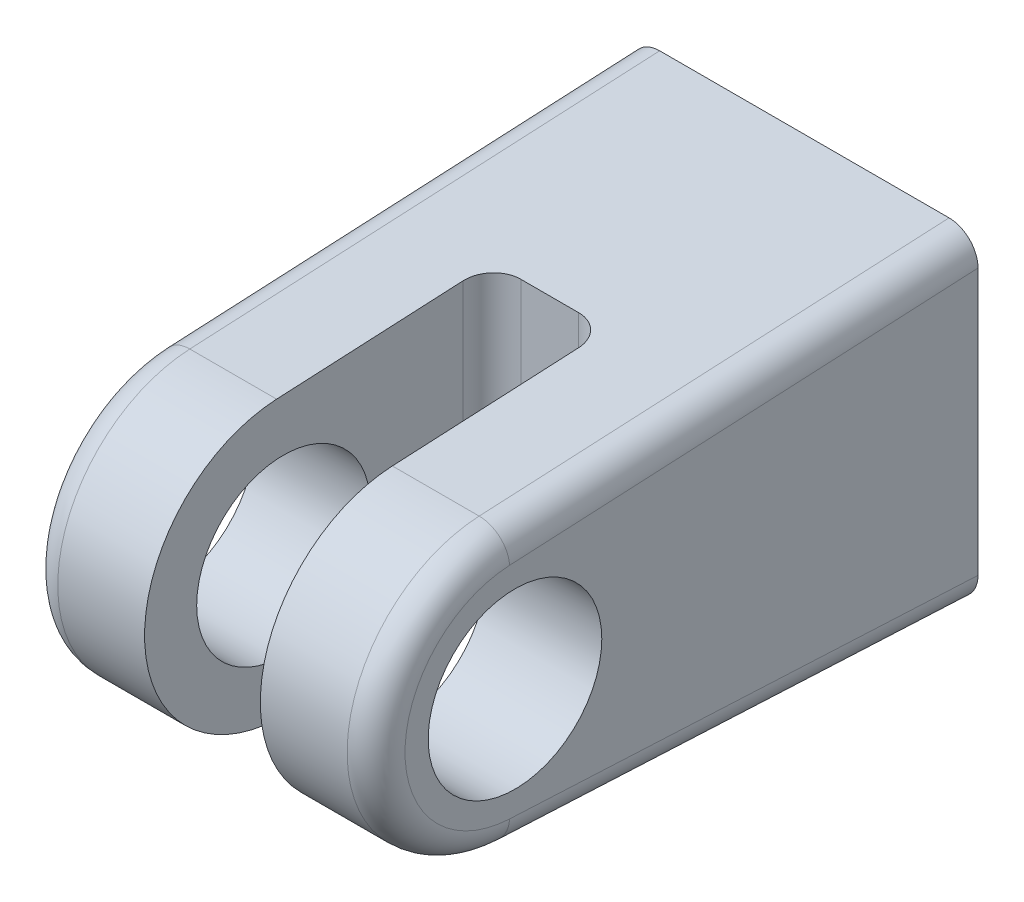
ISO-10303-21;
HEADER;
FILE_DESCRIPTION(('STEP AP214'),'2;1');
FILE_NAME('part.step','',(''),(''),'','','');
FILE_SCHEMA(('AUTOMOTIVE_DESIGN { 1 0 10303 214 1 1 1 1 }'));
ENDSEC;
DATA;
#1=APPLICATION_CONTEXT('core data for automotive mechanical design processes');
#2=APPLICATION_PROTOCOL_DEFINITION('international standard','automotive_design',2000,#1);
#3=PRODUCT_CONTEXT('',#1,'mechanical');
#4=PRODUCT('Part','Part','',(#3));
#5=PRODUCT_RELATED_PRODUCT_CATEGORY('part','',(#4));
#6=PRODUCT_DEFINITION_FORMATION('','',#4);
#7=PRODUCT_DEFINITION_CONTEXT('part definition',#1,'design');
#8=PRODUCT_DEFINITION('design','',#6,#7);
#9=PRODUCT_DEFINITION_SHAPE('','',#8);
#10=(LENGTH_UNIT() NAMED_UNIT(*) SI_UNIT(.MILLI.,.METRE.));
#11=(NAMED_UNIT(*) PLANE_ANGLE_UNIT() SI_UNIT($,.RADIAN.));
#12=(NAMED_UNIT(*) SI_UNIT($,.STERADIAN.) SOLID_ANGLE_UNIT());
#13=UNCERTAINTY_MEASURE_WITH_UNIT(LENGTH_MEASURE(1.E-05),#10,'distance_accuracy_value','');
#14=(GEOMETRIC_REPRESENTATION_CONTEXT(3) GLOBAL_UNCERTAINTY_ASSIGNED_CONTEXT((#13)) GLOBAL_UNIT_ASSIGNED_CONTEXT((#10,
#11,#12)) REPRESENTATION_CONTEXT('',''));
#15=CARTESIAN_POINT('',(0.,0.,0.));
#16=DIRECTION('',(0.,0.,1.));
#17=DIRECTION('',(1.,0.,0.));
#18=AXIS2_PLACEMENT_3D('',#15,#16,#17);
#19=CARTESIAN_POINT('',(9.525,0.,25.4));
#20=DIRECTION('',(-1.,0.,0.));
#21=DIRECTION('',(0.,0.,1.));
#22=AXIS2_PLACEMENT_3D('',#19,#20,#21);
#23=CYLINDRICAL_SURFACE('',#22,7.62);
#24=DIRECTION('',(-1.,0.,0.));
#25=VECTOR('',#24,1.);
#26=CARTESIAN_POINT('',(9.525,-7.61063246853942,25.7777213639888));
#27=LINE('',#26,#25);
#28=CARTESIAN_POINT('',(7.9375,-7.61063246853942,25.7777213639888));
#29=VERTEX_POINT('',#28);
#30=CARTESIAN_POINT('',(3.175,-7.61063246853942,25.7777213639888));
#31=VERTEX_POINT('',#30);
#32=EDGE_CURVE('E137',#29,#31,#27,.T.);
#33=ORIENTED_EDGE('',*,*,#32,.F.);
#34=CARTESIAN_POINT('',(7.9375,0.,25.4));
#35=DIRECTION('',(1.,0.,0.));
#36=DIRECTION('',(0.,0.,-1.));
#37=AXIS2_PLACEMENT_3D('',#34,#35,#36);
#38=CIRCLE('',#37,7.62);
#39=CARTESIAN_POINT('',(7.9375,7.61063246853942,25.7777213639888));
#40=VERTEX_POINT('',#39);
#41=EDGE_CURVE('E205',#29,#40,#38,.F.);
#42=ORIENTED_EDGE('',*,*,#41,.T.);
#43=DIRECTION('',(-1.,0.,0.));
#44=VECTOR('',#43,1.);
#45=CARTESIAN_POINT('',(9.525,7.61063246853942,25.7777213639888));
#46=LINE('',#45,#44);
#47=CARTESIAN_POINT('',(3.175,7.61063246853942,25.7777213639888));
#48=VERTEX_POINT('',#47);
#49=EDGE_CURVE('E156',#40,#48,#46,.T.);
#50=ORIENTED_EDGE('',*,*,#49,.T.);
#51=CARTESIAN_POINT('',(3.175,0.,25.4));
#52=DIRECTION('',(1.,0.,0.));
#53=DIRECTION('',(0.,0.,-1.));
#54=AXIS2_PLACEMENT_3D('',#51,#52,#53);
#55=CIRCLE('',#54,7.62);
#56=EDGE_CURVE('E154',#48,#31,#55,.T.);
#57=ORIENTED_EDGE('',*,*,#56,.T.);
#58=EDGE_LOOP('',(#33,#42,#50,#57));
#59=FACE_BOUND('',#58,.T.);
#60=ADVANCED_FACE('F36',(#59),#23,.T.);
#61=CARTESIAN_POINT('',(9.525,8.89,0.));
#62=DIRECTION('',(0.,0.,1.));
#63=DIRECTION('',(0.,-1.,0.));
#64=AXIS2_PLACEMENT_3D('',#61,#62,#63);
#65=PLANE('',#64);
#66=CARTESIAN_POINT('',(0.,0.,0.));
#67=DIRECTION('',(0.,0.,-1.));
#68=DIRECTION('',(0.,1.,0.));
#69=AXIS2_PLACEMENT_3D('',#66,#67,#68);
#70=CIRCLE('',#69,6.35);
#71=CARTESIAN_POINT('',(0.,6.35,0.));
#72=VERTEX_POINT('',#71);
#73=EDGE_CURVE('E229',#72,#72,#70,.T.);
#74=ORIENTED_EDGE('',*,*,#73,.F.);
#75=EDGE_LOOP('',(#74));
#76=FACE_BOUND('',#75,.T.);
#77=DIRECTION('',(-1.,0.,0.));
#78=VECTOR('',#77,1.);
#79=CARTESIAN_POINT('',(9.525,-8.89,0.));
#80=LINE('',#79,#78);
#81=CARTESIAN_POINT('',(7.9375,-8.89,0.));
#82=VERTEX_POINT('',#81);
#83=CARTESIAN_POINT('',(-7.93749999999999,-8.89,0.));
#84=VERTEX_POINT('',#83);
#85=EDGE_CURVE('E272',#82,#84,#80,.T.);
#86=ORIENTED_EDGE('',*,*,#85,.T.);
#87=CARTESIAN_POINT('',(-7.9375,-7.30054602886092,0.));
#88=DIRECTION('',(0.,0.,1.));
#89=DIRECTION('',(0.,-1.,0.));
#90=AXIS2_PLACEMENT_3D('',#87,#88,#89);
#91=ELLIPSE('',#90,1.58945397113908,1.5875);
#92=CARTESIAN_POINT('',(-9.525,-7.30054602886092,0.));
#93=VERTEX_POINT('',#92);
#94=EDGE_CURVE('E188',#84,#93,#91,.F.);
#95=ORIENTED_EDGE('',*,*,#94,.T.);
#96=DIRECTION('',(0.,1.,0.));
#97=VECTOR('',#96,1.);
#98=CARTESIAN_POINT('',(-9.525,8.89,0.));
#99=LINE('',#98,#97);
#100=CARTESIAN_POINT('',(-9.525,7.30054602886092,0.));
#101=VERTEX_POINT('',#100);
#102=EDGE_CURVE('E256',#93,#101,#99,.T.);
#103=ORIENTED_EDGE('',*,*,#102,.T.);
#104=CARTESIAN_POINT('',(-7.9375,7.30054602886092,0.));
#105=DIRECTION('',(0.,0.,1.));
#106=DIRECTION('',(0.,-1.,0.));
#107=AXIS2_PLACEMENT_3D('',#104,#105,#106);
#108=ELLIPSE('',#107,1.58945397113908,1.5875);
#109=CARTESIAN_POINT('',(-7.93749999999999,8.89,0.));
#110=VERTEX_POINT('',#109);
#111=EDGE_CURVE('E184',#101,#110,#108,.F.);
#112=ORIENTED_EDGE('',*,*,#111,.T.);
#113=DIRECTION('',(-1.,0.,0.));
#114=VECTOR('',#113,1.);
#115=CARTESIAN_POINT('',(9.525,8.89,0.));
#116=LINE('',#115,#114);
#117=CARTESIAN_POINT('',(7.9375,8.89,0.));
#118=VERTEX_POINT('',#117);
#119=EDGE_CURVE('E164',#118,#110,#116,.T.);
#120=ORIENTED_EDGE('',*,*,#119,.F.);
#121=CARTESIAN_POINT('',(7.9375,7.30054602886092,0.));
#122=DIRECTION('',(0.,0.,1.));
#123=DIRECTION('',(0.,1.,0.));
#124=AXIS2_PLACEMENT_3D('',#121,#122,#123);
#125=ELLIPSE('',#124,1.58945397113908,1.5875);
#126=CARTESIAN_POINT('',(9.525,7.30054602886092,0.));
#127=VERTEX_POINT('',#126);
#128=EDGE_CURVE('E182',#118,#127,#125,.F.);
#129=ORIENTED_EDGE('',*,*,#128,.T.);
#130=DIRECTION('',(0.,1.,0.));
#131=VECTOR('',#130,1.);
#132=CARTESIAN_POINT('',(9.525,8.89,0.));
#133=LINE('',#132,#131);
#134=CARTESIAN_POINT('',(9.525,-7.30054602886092,0.));
#135=VERTEX_POINT('',#134);
#136=EDGE_CURVE('E274',#135,#127,#133,.T.);
#137=ORIENTED_EDGE('',*,*,#136,.F.);
#138=CARTESIAN_POINT('',(7.9375,-7.30054602886092,0.));
#139=DIRECTION('',(0.,0.,1.));
#140=DIRECTION('',(0.,1.,0.));
#141=AXIS2_PLACEMENT_3D('',#138,#139,#140);
#142=ELLIPSE('',#141,1.58945397113908,1.5875);
#143=EDGE_CURVE('E186',#135,#82,#142,.F.);
#144=ORIENTED_EDGE('',*,*,#143,.T.);
#145=EDGE_LOOP('',(#86,#95,#103,#112,#120,#129,#137,#144));
#146=FACE_BOUND('',#145,.T.);
#147=ADVANCED_FACE('F250',(#76,#146),#65,.F.);
#148=CARTESIAN_POINT('',(9.525,8.89,0.));
#149=DIRECTION('',(0.,-0.998770665162654,-0.0495697328069288));
#150=DIRECTION('',(0.,0.0495697328069289,-0.998770665162654));
#151=AXIS2_PLACEMENT_3D('',#148,#149,#150);
#152=PLANE('',#151);
#153=ORIENTED_EDGE('',*,*,#119,.T.);
#154=DIRECTION('',(0.,-0.0495697328069289,0.998770665162654));
#155=VECTOR('',#154,1.);
#156=CARTESIAN_POINT('',(-7.9375,8.89,0.));
#157=LINE('',#156,#155);
#158=CARTESIAN_POINT('',(-7.93749999999999,7.61063246853942,25.7777213639888));
#159=VERTEX_POINT('',#158);
#160=EDGE_CURVE('E217',#110,#159,#157,.T.);
#161=ORIENTED_EDGE('',*,*,#160,.T.);
#162=CARTESIAN_POINT('',(-3.175,7.61063246853942,25.7777213639888));
#163=VERTEX_POINT('',#162);
#164=EDGE_CURVE('E149',#163,#159,#46,.T.);
#165=ORIENTED_EDGE('',*,*,#164,.F.);
#166=DIRECTION('',(0.,0.0495697328069289,-0.998770665162654));
#167=VECTOR('',#166,1.);
#168=CARTESIAN_POINT('',(-3.17500000000001,8.89,0.));
#169=LINE('',#168,#167);
#170=CARTESIAN_POINT('',(-3.175,8.11786967514889,15.5575));
#171=VERTEX_POINT('',#170);
#172=EDGE_CURVE('E276',#163,#171,#169,.T.);
#173=ORIENTED_EDGE('',*,*,#172,.T.);
#174=CARTESIAN_POINT('',(-1.5875,8.11786967514889,15.5575));
#175=DIRECTION('',(0.,-0.998770665162654,-0.0495697328069288));
#176=DIRECTION('',(0.,-0.0495697328069289,0.998770665162654));
#177=AXIS2_PLACEMENT_3D('',#174,#175,#176);
#178=ELLIPSE('',#177,1.58945397113908,1.5875);
#179=CARTESIAN_POINT('',(-1.5875,8.19665848380717,13.97));
#180=VERTEX_POINT('',#179);
#181=EDGE_CURVE('E219',#171,#180,#178,.T.);
#182=ORIENTED_EDGE('',*,*,#181,.T.);
#183=DIRECTION('',(1.,0.,0.));
#184=VECTOR('',#183,1.);
#185=CARTESIAN_POINT('',(9.525,8.19665848380717,13.97));
#186=LINE('',#185,#184);
#187=CARTESIAN_POINT('',(1.5875,8.19665848380717,13.97));
#188=VERTEX_POINT('',#187);
#189=EDGE_CURVE('E280',#180,#188,#186,.T.);
#190=ORIENTED_EDGE('',*,*,#189,.T.);
#191=CARTESIAN_POINT('',(1.5875,8.11786967514889,15.5575));
#192=DIRECTION('',(0.,-0.998770665162654,-0.0495697328069288));
#193=DIRECTION('',(0.,-0.0495697328069289,0.998770665162654));
#194=AXIS2_PLACEMENT_3D('',#191,#192,#193);
#195=ELLIPSE('',#194,1.58945397113908,1.5875);
#196=CARTESIAN_POINT('',(3.175,8.11786967514889,15.5575));
#197=VERTEX_POINT('',#196);
#198=EDGE_CURVE('E45',#188,#197,#195,.T.);
#199=ORIENTED_EDGE('',*,*,#198,.T.);
#200=DIRECTION('',(0.,-0.0495697328069289,0.998770665162654));
#201=VECTOR('',#200,1.);
#202=CARTESIAN_POINT('',(3.175,8.89,0.));
#203=LINE('',#202,#201);
#204=EDGE_CURVE('E158',#197,#48,#203,.T.);
#205=ORIENTED_EDGE('',*,*,#204,.T.);
#206=ORIENTED_EDGE('',*,*,#49,.F.);
#207=DIRECTION('',(0.,-0.0495697328069289,0.998770665162654));
#208=VECTOR('',#207,1.);
#209=CARTESIAN_POINT('',(7.9375,8.89,0.));
#210=LINE('',#209,#208);
#211=EDGE_CURVE('E215',#40,#118,#210,.F.);
#212=ORIENTED_EDGE('',*,*,#211,.T.);
#213=EDGE_LOOP('',(#153,#161,#165,#173,#182,#190,#199,#205,#206,#212));
#214=FACE_BOUND('',#213,.T.);
#215=ADVANCED_FACE('F246',(#214),#152,.F.);
#216=ORIENTED_EDGE('',*,*,#164,.T.);
#217=CARTESIAN_POINT('',(-7.9375,0.,25.4));
#218=DIRECTION('',(1.,0.,0.));
#219=DIRECTION('',(0.,0.,-1.));
#220=AXIS2_PLACEMENT_3D('',#217,#218,#219);
#221=CIRCLE('',#220,7.62);
#222=CARTESIAN_POINT('',(-7.93749999999999,-7.61063246853942,25.7777213639888));
#223=VERTEX_POINT('',#222);
#224=EDGE_CURVE('E196',#159,#223,#221,.T.);
#225=ORIENTED_EDGE('',*,*,#224,.T.);
#226=CARTESIAN_POINT('',(-3.175,-7.61063246853942,25.7777213639888));
#227=VERTEX_POINT('',#226);
#228=EDGE_CURVE('E150',#227,#223,#27,.T.);
#229=ORIENTED_EDGE('',*,*,#228,.F.);
#230=CARTESIAN_POINT('',(-3.175,0.,25.4));
#231=DIRECTION('',(-1.,0.,0.));
#232=DIRECTION('',(0.,0.,1.));
#233=AXIS2_PLACEMENT_3D('',#230,#231,#232);
#234=CIRCLE('',#233,7.62);
#235=EDGE_CURVE('E270',#227,#163,#234,.T.);
#236=ORIENTED_EDGE('',*,*,#235,.T.);
#237=EDGE_LOOP('',(#216,#225,#229,#236));
#238=FACE_BOUND('',#237,.T.);
#239=ADVANCED_FACE('F267',(#238),#23,.T.);
#240=CARTESIAN_POINT('',(9.525,-8.89,0.));
#241=DIRECTION('',(0.,0.998770665162654,-0.0495697328069286));
#242=DIRECTION('',(0.,0.0495697328069286,0.998770665162654));
#243=AXIS2_PLACEMENT_3D('',#240,#241,#242);
#244=PLANE('',#243);
#245=ORIENTED_EDGE('',*,*,#228,.T.);
#246=DIRECTION('',(0.,-0.0495697328069286,-0.998770665162654));
#247=VECTOR('',#246,1.);
#248=CARTESIAN_POINT('',(-7.9375,-8.89,0.));
#249=LINE('',#248,#247);
#250=EDGE_CURVE('E179',#223,#84,#249,.T.);
#251=ORIENTED_EDGE('',*,*,#250,.T.);
#252=ORIENTED_EDGE('',*,*,#85,.F.);
#253=DIRECTION('',(0.,-0.0495697328069286,-0.998770665162654));
#254=VECTOR('',#253,1.);
#255=CARTESIAN_POINT('',(7.9375,-7.61063246853942,25.7777213639888));
#256=LINE('',#255,#254);
#257=EDGE_CURVE('E146',#82,#29,#256,.F.);
#258=ORIENTED_EDGE('',*,*,#257,.T.);
#259=ORIENTED_EDGE('',*,*,#32,.T.);
#260=DIRECTION('',(0.,-0.0495697328069286,-0.998770665162654));
#261=VECTOR('',#260,1.);
#262=CARTESIAN_POINT('',(3.175,-8.89,0.));
#263=LINE('',#262,#261);
#264=CARTESIAN_POINT('',(3.175,-8.1178696751489,15.5575));
#265=VERTEX_POINT('',#264);
#266=EDGE_CURVE('E142',#31,#265,#263,.T.);
#267=ORIENTED_EDGE('',*,*,#266,.T.);
#268=CARTESIAN_POINT('',(1.5875,-8.1178696751489,15.5575));
#269=DIRECTION('',(0.,0.998770665162654,-0.0495697328069286));
#270=DIRECTION('',(0.,-0.0495697328069286,-0.998770665162654));
#271=AXIS2_PLACEMENT_3D('',#268,#269,#270);
#272=ELLIPSE('',#271,1.58945397113908,1.5875);
#273=CARTESIAN_POINT('',(1.5875,-8.19665848380717,13.97));
#274=VERTEX_POINT('',#273);
#275=EDGE_CURVE('E11',#265,#274,#272,.T.);
#276=ORIENTED_EDGE('',*,*,#275,.T.);
#277=DIRECTION('',(-1.,0.,0.));
#278=VECTOR('',#277,1.);
#279=CARTESIAN_POINT('',(9.525,-8.19665848380717,13.97));
#280=LINE('',#279,#278);
#281=CARTESIAN_POINT('',(-1.5875,-8.19665848380717,13.97));
#282=VERTEX_POINT('',#281);
#283=EDGE_CURVE('E163',#274,#282,#280,.T.);
#284=ORIENTED_EDGE('',*,*,#283,.T.);
#285=CARTESIAN_POINT('',(-1.5875,-8.1178696751489,15.5575));
#286=DIRECTION('',(0.,0.998770665162654,-0.0495697328069286));
#287=DIRECTION('',(0.,-0.0495697328069286,-0.998770665162654));
#288=AXIS2_PLACEMENT_3D('',#285,#286,#287);
#289=ELLIPSE('',#288,1.58945397113908,1.5875);
#290=CARTESIAN_POINT('',(-3.175,-8.1178696751489,15.5575));
#291=VERTEX_POINT('',#290);
#292=EDGE_CURVE('E221',#282,#291,#289,.T.);
#293=ORIENTED_EDGE('',*,*,#292,.T.);
#294=DIRECTION('',(0.,0.0495697328069286,0.998770665162654));
#295=VECTOR('',#294,1.);
#296=CARTESIAN_POINT('',(-3.17500000000001,-8.89,0.));
#297=LINE('',#296,#295);
#298=EDGE_CURVE('E167',#291,#227,#297,.T.);
#299=ORIENTED_EDGE('',*,*,#298,.T.);
#300=EDGE_LOOP('',(#245,#251,#252,#258,#259,#267,#276,#284,#293,#299));
#301=FACE_BOUND('',#300,.T.);
#302=ADVANCED_FACE('F140',(#301),#244,.F.);
#303=CARTESIAN_POINT('',(9.525,0.,25.4));
#304=DIRECTION('',(1.,0.,0.));
#305=DIRECTION('',(0.,0.,-1.));
#306=AXIS2_PLACEMENT_3D('',#303,#304,#305);
#307=PLANE('',#306);
#308=CARTESIAN_POINT('',(9.525,0.,25.4));
#309=DIRECTION('',(1.,0.,0.));
#310=DIRECTION('',(0.,0.,-1.));
#311=AXIS2_PLACEMENT_3D('',#308,#309,#310);
#312=CIRCLE('',#311,4.7625);
#313=CARTESIAN_POINT('',(9.525,0.,20.6375));
#314=VERTEX_POINT('',#313);
#315=EDGE_CURVE('E285',#314,#314,#312,.T.);
#316=ORIENTED_EDGE('',*,*,#315,.F.);
#317=EDGE_LOOP('',(#316));
#318=FACE_BOUND('',#317,.T.);
#319=CARTESIAN_POINT('',(9.525,0.,25.4));
#320=DIRECTION('',(1.,0.,0.));
#321=DIRECTION('',(0.,0.,-1.));
#322=AXIS2_PLACEMENT_3D('',#319,#320,#321);
#323=CIRCLE('',#322,6.0325);
#324=CARTESIAN_POINT('',(9.525,6.0250840375937,25.6990294131578));
#325=VERTEX_POINT('',#324);
#326=CARTESIAN_POINT('',(9.525,-6.02508403759371,25.6990294131578));
#327=VERTEX_POINT('',#326);
#328=EDGE_CURVE('E200',#325,#327,#323,.T.);
#329=ORIENTED_EDGE('',*,*,#328,.T.);
#330=DIRECTION('',(0.,-0.0495697328069286,-0.998770665162654));
#331=VECTOR('',#330,1.);
#332=CARTESIAN_POINT('',(9.525,-7.30445156905429,-0.0786919508310134));
#333=LINE('',#332,#331);
#334=EDGE_CURVE('E202',#327,#135,#333,.T.);
#335=ORIENTED_EDGE('',*,*,#334,.T.);
#336=ORIENTED_EDGE('',*,*,#136,.T.);
#337=DIRECTION('',(0.,-0.0495697328069289,0.998770665162654));
#338=VECTOR('',#337,1.);
#339=CARTESIAN_POINT('',(9.525,6.0250840375937,25.6990294131578));
#340=LINE('',#339,#338);
#341=EDGE_CURVE('E198',#127,#325,#340,.T.);
#342=ORIENTED_EDGE('',*,*,#341,.T.);
#343=EDGE_LOOP('',(#329,#335,#336,#342));
#344=FACE_BOUND('',#343,.T.);
#345=ADVANCED_FACE('F350',(#318,#344),#307,.T.);
#346=CARTESIAN_POINT('',(-9.525,0.,25.4));
#347=DIRECTION('',(1.,0.,0.));
#348=DIRECTION('',(0.,0.,-1.));
#349=AXIS2_PLACEMENT_3D('',#346,#347,#348);
#350=PLANE('',#349);
#351=CARTESIAN_POINT('',(-9.525,0.,25.4));
#352=DIRECTION('',(1.,0.,0.));
#353=DIRECTION('',(0.,0.,-1.));
#354=AXIS2_PLACEMENT_3D('',#351,#352,#353);
#355=CIRCLE('',#354,4.7625);
#356=CARTESIAN_POINT('',(-9.525,0.,20.6375));
#357=VERTEX_POINT('',#356);
#358=EDGE_CURVE('E177',#357,#357,#355,.T.);
#359=ORIENTED_EDGE('',*,*,#358,.T.);
#360=EDGE_LOOP('',(#359));
#361=FACE_BOUND('',#360,.T.);
#362=ORIENTED_EDGE('',*,*,#102,.F.);
#363=DIRECTION('',(0.,-0.0495697328069286,-0.998770665162654));
#364=VECTOR('',#363,1.);
#365=CARTESIAN_POINT('',(-9.525,-6.02508403759371,25.6990294131578));
#366=LINE('',#365,#364);
#367=CARTESIAN_POINT('',(-9.525,-6.02508403759371,25.6990294131578));
#368=VERTEX_POINT('',#367);
#369=EDGE_CURVE('E194',#93,#368,#366,.F.);
#370=ORIENTED_EDGE('',*,*,#369,.T.);
#371=CARTESIAN_POINT('',(-9.525,0.,25.4));
#372=DIRECTION('',(1.,0.,0.));
#373=DIRECTION('',(0.,0.,-1.));
#374=AXIS2_PLACEMENT_3D('',#371,#372,#373);
#375=CIRCLE('',#374,6.0325);
#376=CARTESIAN_POINT('',(-9.525,6.02508403759371,25.6990294131578));
#377=VERTEX_POINT('',#376);
#378=EDGE_CURVE('E192',#368,#377,#375,.F.);
#379=ORIENTED_EDGE('',*,*,#378,.T.);
#380=DIRECTION('',(0.,-0.0495697328069289,0.998770665162654));
#381=VECTOR('',#380,1.);
#382=CARTESIAN_POINT('',(-9.525,6.0250840375937,25.6990294131578));
#383=LINE('',#382,#381);
#384=EDGE_CURVE('E190',#377,#101,#383,.F.);
#385=ORIENTED_EDGE('',*,*,#384,.T.);
#386=EDGE_LOOP('',(#362,#370,#379,#385));
#387=FACE_BOUND('',#386,.T.);
#388=ADVANCED_FACE('F348',(#361,#387),#350,.F.);
#389=CARTESIAN_POINT('',(-3.175,-8.89,13.97));
#390=DIRECTION('',(-1.,0.,0.));
#391=DIRECTION('',(0.,0.,1.));
#392=AXIS2_PLACEMENT_3D('',#389,#390,#391);
#393=PLANE('',#392);
#394=CARTESIAN_POINT('',(-3.175,0.,25.4));
#395=DIRECTION('',(-1.,0.,0.));
#396=DIRECTION('',(0.,0.,1.));
#397=AXIS2_PLACEMENT_3D('',#394,#395,#396);
#398=CIRCLE('',#397,4.7625);
#399=CARTESIAN_POINT('',(-3.175,0.,30.1625));
#400=VERTEX_POINT('',#399);
#401=EDGE_CURVE('E159',#400,#400,#398,.T.);
#402=ORIENTED_EDGE('',*,*,#401,.T.);
#403=EDGE_LOOP('',(#402));
#404=FACE_BOUND('',#403,.T.);
#405=ORIENTED_EDGE('',*,*,#298,.F.);
#406=DIRECTION('',(0.,1.,0.));
#407=VECTOR('',#406,1.);
#408=CARTESIAN_POINT('',(-3.175,8.19665848380717,15.5575));
#409=LINE('',#408,#407);
#410=EDGE_CURVE('E207',#291,#171,#409,.T.);
#411=ORIENTED_EDGE('',*,*,#410,.T.);
#412=ORIENTED_EDGE('',*,*,#172,.F.);
#413=ORIENTED_EDGE('',*,*,#235,.F.);
#414=EDGE_LOOP('',(#405,#411,#412,#413));
#415=FACE_BOUND('',#414,.T.);
#416=ADVANCED_FACE('F342',(#404,#415),#393,.F.);
#417=CARTESIAN_POINT('',(-3.175,-8.89,13.97));
#418=DIRECTION('',(0.,0.,-1.));
#419=DIRECTION('',(-1.,0.,0.));
#420=AXIS2_PLACEMENT_3D('',#417,#418,#419);
#421=PLANE('',#420);
#422=ORIENTED_EDGE('',*,*,#189,.F.);
#423=DIRECTION('',(0.,1.,0.));
#424=VECTOR('',#423,1.);
#425=CARTESIAN_POINT('',(-1.5875,-8.19665848380717,13.97));
#426=LINE('',#425,#424);
#427=EDGE_CURVE('E212',#180,#282,#426,.F.);
#428=ORIENTED_EDGE('',*,*,#427,.T.);
#429=ORIENTED_EDGE('',*,*,#283,.F.);
#430=DIRECTION('',(0.,1.,0.));
#431=VECTOR('',#430,1.);
#432=CARTESIAN_POINT('',(1.5875,8.19665848380717,13.97));
#433=LINE('',#432,#431);
#434=EDGE_CURVE('E210',#274,#188,#433,.T.);
#435=ORIENTED_EDGE('',*,*,#434,.T.);
#436=EDGE_LOOP('',(#422,#428,#429,#435));
#437=FACE_BOUND('',#436,.T.);
#438=ADVANCED_FACE('F357',(#437),#421,.F.);
#439=CARTESIAN_POINT('',(3.175,-8.89,13.97));
#440=DIRECTION('',(1.,0.,0.));
#441=DIRECTION('',(0.,0.,-1.));
#442=AXIS2_PLACEMENT_3D('',#439,#440,#441);
#443=PLANE('',#442);
#444=CARTESIAN_POINT('',(3.175,0.,25.4));
#445=DIRECTION('',(1.,0.,0.));
#446=DIRECTION('',(0.,0.,-1.));
#447=AXIS2_PLACEMENT_3D('',#444,#445,#446);
#448=CIRCLE('',#447,4.7625);
#449=CARTESIAN_POINT('',(3.175,0.,20.6375));
#450=VERTEX_POINT('',#449);
#451=EDGE_CURVE('E174',#450,#450,#448,.T.);
#452=ORIENTED_EDGE('',*,*,#451,.T.);
#453=EDGE_LOOP('',(#452));
#454=FACE_BOUND('',#453,.T.);
#455=ORIENTED_EDGE('',*,*,#204,.F.);
#456=DIRECTION('',(0.,1.,0.));
#457=VECTOR('',#456,1.);
#458=CARTESIAN_POINT('',(3.175,-8.19665848380717,15.5575));
#459=LINE('',#458,#457);
#460=EDGE_CURVE('E162',#197,#265,#459,.F.);
#461=ORIENTED_EDGE('',*,*,#460,.T.);
#462=ORIENTED_EDGE('',*,*,#266,.F.);
#463=ORIENTED_EDGE('',*,*,#56,.F.);
#464=EDGE_LOOP('',(#455,#461,#462,#463));
#465=FACE_BOUND('',#464,.T.);
#466=ADVANCED_FACE('F161',(#454,#465),#443,.F.);
#467=CARTESIAN_POINT('',(-9.525,0.,25.4));
#468=DIRECTION('',(1.,0.,0.));
#469=DIRECTION('',(0.,0.,-1.));
#470=AXIS2_PLACEMENT_3D('',#467,#468,#469);
#471=CYLINDRICAL_SURFACE('',#470,4.7625);
#472=ORIENTED_EDGE('',*,*,#315,.T.);
#473=EDGE_LOOP('',(#472));
#474=FACE_BOUND('',#473,.T.);
#475=ORIENTED_EDGE('',*,*,#451,.F.);
#476=EDGE_LOOP('',(#475));
#477=FACE_BOUND('',#476,.T.);
#478=ADVANCED_FACE('F406',(#474,#477),#471,.F.);
#479=ORIENTED_EDGE('',*,*,#358,.F.);
#480=EDGE_LOOP('',(#479));
#481=FACE_BOUND('',#480,.T.);
#482=ORIENTED_EDGE('',*,*,#401,.F.);
#483=EDGE_LOOP('',(#482));
#484=FACE_BOUND('',#483,.T.);
#485=ADVANCED_FACE('F301',(#481,#484),#471,.F.);
#486=CARTESIAN_POINT('',(0.,0.,9.525));
#487=DIRECTION('',(0.,0.,-1.));
#488=DIRECTION('',(0.,1.,0.));
#489=AXIS2_PLACEMENT_3D('',#486,#487,#488);
#490=CYLINDRICAL_SURFACE('',#489,6.35);
#491=CARTESIAN_POINT('',(0.,0.,9.525));
#492=DIRECTION('',(0.,0.,-1.));
#493=DIRECTION('',(0.,1.,0.));
#494=AXIS2_PLACEMENT_3D('',#491,#492,#493);
#495=CIRCLE('',#494,6.35);
#496=CARTESIAN_POINT('',(0.,6.35,9.525));
#497=VERTEX_POINT('',#496);
#498=EDGE_CURVE('E288',#497,#497,#495,.T.);
#499=ORIENTED_EDGE('',*,*,#498,.F.);
#500=EDGE_LOOP('',(#499));
#501=FACE_BOUND('',#500,.T.);
#502=ORIENTED_EDGE('',*,*,#73,.T.);
#503=EDGE_LOOP('',(#502));
#504=FACE_BOUND('',#503,.T.);
#505=ADVANCED_FACE('F298',(#501,#504),#490,.F.);
#506=CARTESIAN_POINT('',(0.,0.,9.525));
#507=DIRECTION('',(0.,0.,-1.));
#508=DIRECTION('',(0.,1.,0.));
#509=AXIS2_PLACEMENT_3D('',#506,#507,#508);
#510=PLANE('',#509);
#511=ORIENTED_EDGE('',*,*,#498,.T.);
#512=EDGE_LOOP('',(#511));
#513=FACE_BOUND('',#512,.T.);
#514=ADVANCED_FACE('F296',(#513),#510,.T.);
#515=CARTESIAN_POINT('',(-7.9375,7.30445156905429,-0.0786919508309994));
#516=DIRECTION('',(0.,-0.0495697328069289,0.998770665162654));
#517=DIRECTION('',(0.,-0.998770665162654,-0.0495697328069288));
#518=AXIS2_PLACEMENT_3D('',#515,#516,#517);
#519=CYLINDRICAL_SURFACE('',#518,1.5875);
#520=ORIENTED_EDGE('',*,*,#111,.F.);
#521=ORIENTED_EDGE('',*,*,#384,.F.);
#522=CARTESIAN_POINT('',(-7.9375,6.0250840375937,25.6990294131578));
#523=DIRECTION('',(0.,-0.0495697328069288,0.998770665162654));
#524=DIRECTION('',(0.,-0.998770665162654,-0.0495697328069288));
#525=AXIS2_PLACEMENT_3D('',#522,#523,#524);
#526=CIRCLE('',#525,1.5875);
#527=EDGE_CURVE('E227',#159,#377,#526,.T.);
#528=ORIENTED_EDGE('',*,*,#527,.F.);
#529=ORIENTED_EDGE('',*,*,#160,.F.);
#530=EDGE_LOOP('',(#520,#521,#528,#529));
#531=FACE_BOUND('',#530,.T.);
#532=ADVANCED_FACE('F259',(#531),#519,.T.);
#533=CARTESIAN_POINT('',(-7.9375,0.,25.4));
#534=DIRECTION('',(1.,0.,0.));
#535=DIRECTION('',(0.,0.,-1.));
#536=AXIS2_PLACEMENT_3D('',#533,#534,#535);
#537=TOROIDAL_SURFACE('',#536,6.0325,1.5875);
#538=ORIENTED_EDGE('',*,*,#527,.T.);
#539=ORIENTED_EDGE('',*,*,#378,.F.);
#540=CARTESIAN_POINT('',(-7.9375,-6.02508403759371,25.6990294131578));
#541=DIRECTION('',(0.,-0.0495697328069288,-0.998770665162654));
#542=DIRECTION('',(0.,0.998770665162654,-0.0495697328069288));
#543=AXIS2_PLACEMENT_3D('',#540,#541,#542);
#544=CIRCLE('',#543,1.5875);
#545=EDGE_CURVE('E224',#223,#368,#544,.T.);
#546=ORIENTED_EDGE('',*,*,#545,.F.);
#547=ORIENTED_EDGE('',*,*,#224,.F.);
#548=EDGE_LOOP('',(#538,#539,#546,#547));
#549=FACE_BOUND('',#548,.T.);
#550=ADVANCED_FACE('F317',(#549),#537,.T.);
#551=CARTESIAN_POINT('',(-7.9375,-7.30445156905429,-0.0786919508310012));
#552=DIRECTION('',(0.,-0.0495697328069286,-0.998770665162654));
#553=DIRECTION('',(0.,0.998770665162654,-0.0495697328069286));
#554=AXIS2_PLACEMENT_3D('',#551,#552,#553);
#555=CYLINDRICAL_SURFACE('',#554,1.5875);
#556=ORIENTED_EDGE('',*,*,#545,.T.);
#557=ORIENTED_EDGE('',*,*,#369,.F.);
#558=ORIENTED_EDGE('',*,*,#94,.F.);
#559=ORIENTED_EDGE('',*,*,#250,.F.);
#560=EDGE_LOOP('',(#556,#557,#558,#559));
#561=FACE_BOUND('',#560,.T.);
#562=ADVANCED_FACE('F314',(#561),#555,.T.);
#563=CARTESIAN_POINT('',(7.9375,6.0250840375937,25.6990294131578));
#564=DIRECTION('',(0.,0.0495697328069289,-0.998770665162654));
#565=DIRECTION('',(0.,0.998770665162654,0.0495697328069288));
#566=AXIS2_PLACEMENT_3D('',#563,#564,#565);
#567=CYLINDRICAL_SURFACE('',#566,1.5875);
#568=ORIENTED_EDGE('',*,*,#128,.F.);
#569=ORIENTED_EDGE('',*,*,#211,.F.);
#570=CARTESIAN_POINT('',(7.9375,6.0250840375937,25.6990294131578));
#571=DIRECTION('',(0.,-0.0495697328069288,0.998770665162654));
#572=DIRECTION('',(0.,-0.998770665162654,-0.0495697328069288));
#573=AXIS2_PLACEMENT_3D('',#570,#571,#572);
#574=CIRCLE('',#573,1.5875);
#575=EDGE_CURVE('E40',#325,#40,#574,.T.);
#576=ORIENTED_EDGE('',*,*,#575,.F.);
#577=ORIENTED_EDGE('',*,*,#341,.F.);
#578=EDGE_LOOP('',(#568,#569,#576,#577));
#579=FACE_BOUND('',#578,.T.);
#580=ADVANCED_FACE('F244',(#579),#567,.T.);
#581=CARTESIAN_POINT('',(7.9375,0.,25.4));
#582=DIRECTION('',(1.,0.,0.));
#583=DIRECTION('',(0.,0.,-1.));
#584=AXIS2_PLACEMENT_3D('',#581,#582,#583);
#585=TOROIDAL_SURFACE('',#584,6.0325,1.5875);
#586=ORIENTED_EDGE('',*,*,#575,.T.);
#587=ORIENTED_EDGE('',*,*,#41,.F.);
#588=CARTESIAN_POINT('',(7.9375,-6.02508403759371,25.6990294131578));
#589=DIRECTION('',(0.,-0.0495697328069288,-0.998770665162654));
#590=DIRECTION('',(0.,0.998770665162654,-0.0495697328069288));
#591=AXIS2_PLACEMENT_3D('',#588,#589,#590);
#592=CIRCLE('',#591,1.5875);
#593=EDGE_CURVE('E230',#327,#29,#592,.T.);
#594=ORIENTED_EDGE('',*,*,#593,.F.);
#595=ORIENTED_EDGE('',*,*,#328,.F.);
#596=EDGE_LOOP('',(#586,#587,#594,#595));
#597=FACE_BOUND('',#596,.T.);
#598=ADVANCED_FACE('F239',(#597),#585,.T.);
#599=CARTESIAN_POINT('',(7.9375,-6.02508403759371,25.6990294131578));
#600=DIRECTION('',(0.,0.0495697328069286,0.998770665162654));
#601=DIRECTION('',(0.,-0.998770665162654,0.0495697328069286));
#602=AXIS2_PLACEMENT_3D('',#599,#600,#601);
#603=CYLINDRICAL_SURFACE('',#602,1.5875);
#604=ORIENTED_EDGE('',*,*,#593,.T.);
#605=ORIENTED_EDGE('',*,*,#257,.F.);
#606=ORIENTED_EDGE('',*,*,#143,.F.);
#607=ORIENTED_EDGE('',*,*,#334,.F.);
#608=EDGE_LOOP('',(#604,#605,#606,#607));
#609=FACE_BOUND('',#608,.T.);
#610=ADVANCED_FACE('F324',(#609),#603,.T.);
#611=CARTESIAN_POINT('',(-1.5875,-8.89,15.5575));
#612=DIRECTION('',(0.,-1.,0.));
#613=DIRECTION('',(0.,0.,-1.));
#614=AXIS2_PLACEMENT_3D('',#611,#612,#613);
#615=CYLINDRICAL_SURFACE('',#614,1.5875);
#616=ORIENTED_EDGE('',*,*,#292,.F.);
#617=ORIENTED_EDGE('',*,*,#427,.F.);
#618=ORIENTED_EDGE('',*,*,#181,.F.);
#619=ORIENTED_EDGE('',*,*,#410,.F.);
#620=EDGE_LOOP('',(#616,#617,#618,#619));
#621=FACE_BOUND('',#620,.T.);
#622=ADVANCED_FACE('F327',(#621),#615,.F.);
#623=CARTESIAN_POINT('',(1.5875,-8.89,15.5575));
#624=DIRECTION('',(0.,-1.,0.));
#625=DIRECTION('',(0.,0.,-1.));
#626=AXIS2_PLACEMENT_3D('',#623,#624,#625);
#627=CYLINDRICAL_SURFACE('',#626,1.5875);
#628=ORIENTED_EDGE('',*,*,#275,.F.);
#629=ORIENTED_EDGE('',*,*,#460,.F.);
#630=ORIENTED_EDGE('',*,*,#198,.F.);
#631=ORIENTED_EDGE('',*,*,#434,.F.);
#632=EDGE_LOOP('',(#628,#629,#630,#631));
#633=FACE_BOUND('',#632,.T.);
#634=ADVANCED_FACE('F38',(#633),#627,.F.);
#635=CLOSED_SHELL('',(#60,#147,#215,#239,#302,#345,#388,#416,#438,#466,#478,#485,#505,#514,#532,
#550,#562,#580,#598,#610,#622,#634));
#636=MANIFOLD_SOLID_BREP('B2',#635);
#637=ADVANCED_BREP_SHAPE_REPRESENTATION('',(#18,#636),#14);
#638=SHAPE_DEFINITION_REPRESENTATION(#9,#637);
ENDSEC;
END-ISO-10303-21;
